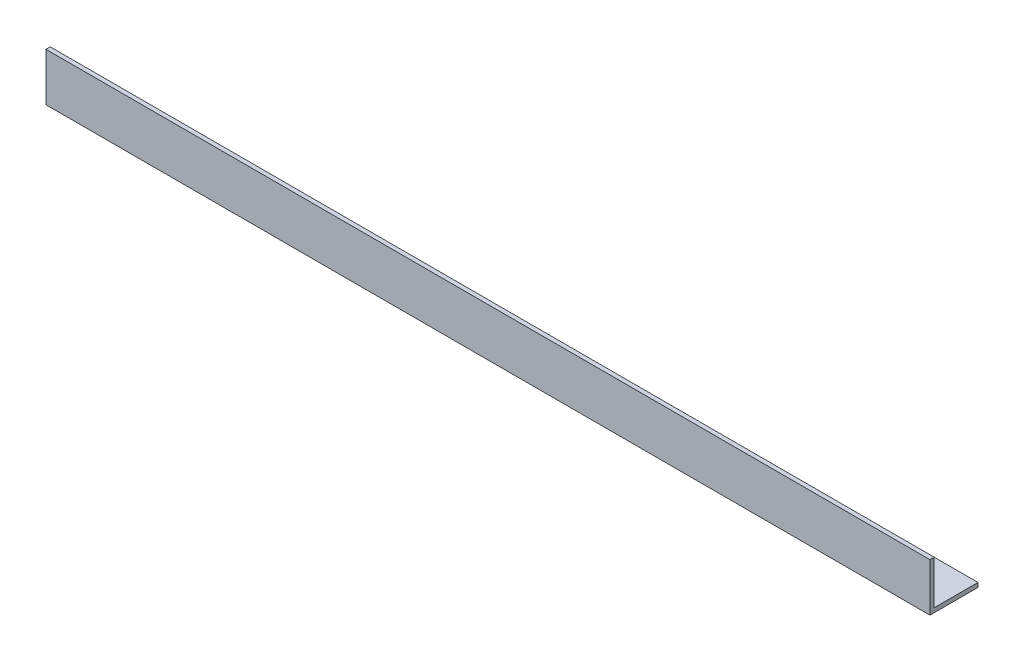
ISO-10303-21;
HEADER;
FILE_DESCRIPTION(('STEP AP214'),'2;1');
FILE_NAME('part.step','',(''),(''),'','','');
FILE_SCHEMA(('AUTOMOTIVE_DESIGN { 1 0 10303 214 1 1 1 1 }'));
ENDSEC;
DATA;
#1=APPLICATION_CONTEXT('core data for automotive mechanical design processes');
#2=APPLICATION_PROTOCOL_DEFINITION('international standard','automotive_design',2000,#1);
#3=PRODUCT_CONTEXT('',#1,'mechanical');
#4=PRODUCT('Part','Part','',(#3));
#5=PRODUCT_RELATED_PRODUCT_CATEGORY('part','',(#4));
#6=PRODUCT_DEFINITION_FORMATION('','',#4);
#7=PRODUCT_DEFINITION_CONTEXT('part definition',#1,'design');
#8=PRODUCT_DEFINITION('design','',#6,#7);
#9=PRODUCT_DEFINITION_SHAPE('','',#8);
#10=(LENGTH_UNIT() NAMED_UNIT(*) SI_UNIT(.MILLI.,.METRE.));
#11=(NAMED_UNIT(*) PLANE_ANGLE_UNIT() SI_UNIT($,.RADIAN.));
#12=(NAMED_UNIT(*) SI_UNIT($,.STERADIAN.) SOLID_ANGLE_UNIT());
#13=UNCERTAINTY_MEASURE_WITH_UNIT(LENGTH_MEASURE(1.E-05),#10,'distance_accuracy_value','');
#14=(GEOMETRIC_REPRESENTATION_CONTEXT(3) GLOBAL_UNCERTAINTY_ASSIGNED_CONTEXT((#13)) GLOBAL_UNIT_ASSIGNED_CONTEXT((#10,
#11,#12)) REPRESENTATION_CONTEXT('',''));
#15=CARTESIAN_POINT('',(0.,0.,0.));
#16=DIRECTION('',(0.,0.,1.));
#17=DIRECTION('',(1.,0.,0.));
#18=AXIS2_PLACEMENT_3D('',#15,#16,#17);
#19=CARTESIAN_POINT('',(620.,0.,0.));
#20=DIRECTION('',(0.,1.,0.));
#21=DIRECTION('',(0.,0.,1.));
#22=AXIS2_PLACEMENT_3D('',#19,#20,#21);
#23=PLANE('',#22);
#24=DIRECTION('',(0.,0.,-1.));
#25=VECTOR('',#24,1.);
#26=CARTESIAN_POINT('',(0.,0.,0.));
#27=LINE('',#26,#25);
#28=CARTESIAN_POINT('',(0.,0.,0.));
#29=VERTEX_POINT('',#28);
#30=CARTESIAN_POINT('',(0.,0.,-33.7));
#31=VERTEX_POINT('',#30);
#32=EDGE_CURVE('E115',#29,#31,#27,.T.);
#33=ORIENTED_EDGE('',*,*,#32,.T.);
#34=DIRECTION('',(-1.,0.,0.));
#35=VECTOR('',#34,1.);
#36=CARTESIAN_POINT('',(620.,0.,-33.7));
#37=LINE('',#36,#35);
#38=CARTESIAN_POINT('',(620.,0.,-33.7));
#39=VERTEX_POINT('',#38);
#40=EDGE_CURVE('E11',#39,#31,#37,.T.);
#41=ORIENTED_EDGE('',*,*,#40,.F.);
#42=DIRECTION('',(0.,0.,-1.));
#43=VECTOR('',#42,1.);
#44=CARTESIAN_POINT('',(620.,0.,0.));
#45=LINE('',#44,#43);
#46=CARTESIAN_POINT('',(620.,0.,0.));
#47=VERTEX_POINT('',#46);
#48=EDGE_CURVE('E80',#47,#39,#45,.T.);
#49=ORIENTED_EDGE('',*,*,#48,.F.);
#50=DIRECTION('',(-1.,0.,0.));
#51=VECTOR('',#50,1.);
#52=CARTESIAN_POINT('',(620.,0.,0.));
#53=LINE('',#52,#51);
#54=EDGE_CURVE('E111',#47,#29,#53,.T.);
#55=ORIENTED_EDGE('',*,*,#54,.T.);
#56=EDGE_LOOP('',(#33,#41,#49,#55));
#57=FACE_BOUND('',#56,.T.);
#58=ADVANCED_FACE('F34',(#57),#23,.F.);
#59=CARTESIAN_POINT('',(620.,3.,-33.7));
#60=DIRECTION('',(0.,0.,-1.));
#61=DIRECTION('',(-1.,0.,0.));
#62=AXIS2_PLACEMENT_3D('',#59,#60,#61);
#63=PLANE('',#62);
#64=DIRECTION('',(0.,-1.,0.));
#65=VECTOR('',#64,1.);
#66=CARTESIAN_POINT('',(0.,3.,-33.7));
#67=LINE('',#66,#65);
#68=CARTESIAN_POINT('',(0.,3.,-33.7));
#69=VERTEX_POINT('',#68);
#70=EDGE_CURVE('E118',#69,#31,#67,.T.);
#71=ORIENTED_EDGE('',*,*,#70,.F.);
#72=DIRECTION('',(-1.,0.,0.));
#73=VECTOR('',#72,1.);
#74=CARTESIAN_POINT('',(620.,3.,-33.7));
#75=LINE('',#74,#73);
#76=CARTESIAN_POINT('',(620.,3.,-33.7));
#77=VERTEX_POINT('',#76);
#78=EDGE_CURVE('E42',#77,#69,#75,.T.);
#79=ORIENTED_EDGE('',*,*,#78,.F.);
#80=DIRECTION('',(0.,-1.,0.));
#81=VECTOR('',#80,1.);
#82=CARTESIAN_POINT('',(620.,3.,-33.7));
#83=LINE('',#82,#81);
#84=EDGE_CURVE('E204',#77,#39,#83,.T.);
#85=ORIENTED_EDGE('',*,*,#84,.T.);
#86=ORIENTED_EDGE('',*,*,#40,.T.);
#87=EDGE_LOOP('',(#71,#79,#85,#86));
#88=FACE_BOUND('',#87,.T.);
#89=ADVANCED_FACE('F136',(#88),#63,.T.);
#90=CARTESIAN_POINT('',(620.,3.,0.));
#91=DIRECTION('',(0.,1.,0.));
#92=DIRECTION('',(0.,0.,1.));
#93=AXIS2_PLACEMENT_3D('',#90,#91,#92);
#94=PLANE('',#93);
#95=DIRECTION('',(0.,0.,-1.));
#96=VECTOR('',#95,1.);
#97=CARTESIAN_POINT('',(0.,3.,0.));
#98=LINE('',#97,#96);
#99=CARTESIAN_POINT('',(0.,3.,-3.));
#100=VERTEX_POINT('',#99);
#101=EDGE_CURVE('E121',#100,#69,#98,.T.);
#102=ORIENTED_EDGE('',*,*,#101,.F.);
#103=DIRECTION('',(-1.,0.,0.));
#104=VECTOR('',#103,1.);
#105=CARTESIAN_POINT('',(620.,3.,-3.));
#106=LINE('',#105,#104);
#107=CARTESIAN_POINT('',(620.,3.,-3.));
#108=VERTEX_POINT('',#107);
#109=EDGE_CURVE('E101',#108,#100,#106,.T.);
#110=ORIENTED_EDGE('',*,*,#109,.F.);
#111=DIRECTION('',(0.,0.,-1.));
#112=VECTOR('',#111,1.);
#113=CARTESIAN_POINT('',(620.,3.,0.));
#114=LINE('',#113,#112);
#115=EDGE_CURVE('E107',#108,#77,#114,.T.);
#116=ORIENTED_EDGE('',*,*,#115,.T.);
#117=ORIENTED_EDGE('',*,*,#78,.T.);
#118=EDGE_LOOP('',(#102,#110,#116,#117));
#119=FACE_BOUND('',#118,.T.);
#120=ADVANCED_FACE('F133',(#119),#94,.T.);
#121=CARTESIAN_POINT('',(620.,33.7,-3.));
#122=DIRECTION('',(0.,0.,-1.));
#123=DIRECTION('',(0.,1.,0.));
#124=AXIS2_PLACEMENT_3D('',#121,#122,#123);
#125=PLANE('',#124);
#126=DIRECTION('',(0.,-1.,0.));
#127=VECTOR('',#126,1.);
#128=CARTESIAN_POINT('',(0.,33.7,-3.));
#129=LINE('',#128,#127);
#130=CARTESIAN_POINT('',(0.,33.7,-3.));
#131=VERTEX_POINT('',#130);
#132=EDGE_CURVE('E96',#131,#100,#129,.T.);
#133=ORIENTED_EDGE('',*,*,#132,.F.);
#134=DIRECTION('',(-1.,0.,0.));
#135=VECTOR('',#134,1.);
#136=CARTESIAN_POINT('',(620.,33.7,-3.));
#137=LINE('',#136,#135);
#138=CARTESIAN_POINT('',(620.,33.7,-3.));
#139=VERTEX_POINT('',#138);
#140=EDGE_CURVE('E91',#139,#131,#137,.T.);
#141=ORIENTED_EDGE('',*,*,#140,.F.);
#142=DIRECTION('',(0.,-1.,0.));
#143=VECTOR('',#142,1.);
#144=CARTESIAN_POINT('',(620.,33.7,-3.));
#145=LINE('',#144,#143);
#146=EDGE_CURVE('E94',#139,#108,#145,.T.);
#147=ORIENTED_EDGE('',*,*,#146,.T.);
#148=ORIENTED_EDGE('',*,*,#109,.T.);
#149=EDGE_LOOP('',(#133,#141,#147,#148));
#150=FACE_BOUND('',#149,.T.);
#151=ADVANCED_FACE('F93',(#150),#125,.T.);
#152=CARTESIAN_POINT('',(620.,33.7,0.));
#153=DIRECTION('',(0.,1.,0.));
#154=DIRECTION('',(0.,0.,1.));
#155=AXIS2_PLACEMENT_3D('',#152,#153,#154);
#156=PLANE('',#155);
#157=DIRECTION('',(0.,0.,-1.));
#158=VECTOR('',#157,1.);
#159=CARTESIAN_POINT('',(0.,33.7,0.));
#160=LINE('',#159,#158);
#161=CARTESIAN_POINT('',(0.,33.7,0.));
#162=VERTEX_POINT('',#161);
#163=EDGE_CURVE('E125',#162,#131,#160,.T.);
#164=ORIENTED_EDGE('',*,*,#163,.F.);
#165=DIRECTION('',(-1.,0.,0.));
#166=VECTOR('',#165,1.);
#167=CARTESIAN_POINT('',(620.,33.7,0.));
#168=LINE('',#167,#166);
#169=CARTESIAN_POINT('',(620.,33.7,0.));
#170=VERTEX_POINT('',#169);
#171=EDGE_CURVE('E71',#170,#162,#168,.T.);
#172=ORIENTED_EDGE('',*,*,#171,.F.);
#173=DIRECTION('',(0.,0.,-1.));
#174=VECTOR('',#173,1.);
#175=CARTESIAN_POINT('',(620.,33.7,0.));
#176=LINE('',#175,#174);
#177=EDGE_CURVE('E105',#170,#139,#176,.T.);
#178=ORIENTED_EDGE('',*,*,#177,.T.);
#179=ORIENTED_EDGE('',*,*,#140,.T.);
#180=EDGE_LOOP('',(#164,#172,#178,#179));
#181=FACE_BOUND('',#180,.T.);
#182=ADVANCED_FACE('F109',(#181),#156,.T.);
#183=CARTESIAN_POINT('',(620.,33.7,0.));
#184=DIRECTION('',(0.,0.,-1.));
#185=DIRECTION('',(0.,1.,0.));
#186=AXIS2_PLACEMENT_3D('',#183,#184,#185);
#187=PLANE('',#186);
#188=DIRECTION('',(0.,-1.,0.));
#189=VECTOR('',#188,1.);
#190=CARTESIAN_POINT('',(0.,33.7,0.));
#191=LINE('',#190,#189);
#192=EDGE_CURVE('E74',#162,#29,#191,.T.);
#193=ORIENTED_EDGE('',*,*,#192,.T.);
#194=ORIENTED_EDGE('',*,*,#54,.F.);
#195=DIRECTION('',(0.,-1.,0.));
#196=VECTOR('',#195,1.);
#197=CARTESIAN_POINT('',(620.,33.7,0.));
#198=LINE('',#197,#196);
#199=EDGE_CURVE('E50',#170,#47,#198,.T.);
#200=ORIENTED_EDGE('',*,*,#199,.F.);
#201=ORIENTED_EDGE('',*,*,#171,.T.);
#202=EDGE_LOOP('',(#193,#194,#200,#201));
#203=FACE_BOUND('',#202,.T.);
#204=ADVANCED_FACE('F141',(#203),#187,.F.);
#205=CARTESIAN_POINT('',(620.,0.,0.));
#206=DIRECTION('',(-1.,0.,0.));
#207=DIRECTION('',(0.,0.,1.));
#208=AXIS2_PLACEMENT_3D('',#205,#206,#207);
#209=PLANE('',#208);
#210=ORIENTED_EDGE('',*,*,#48,.T.);
#211=ORIENTED_EDGE('',*,*,#84,.F.);
#212=ORIENTED_EDGE('',*,*,#115,.F.);
#213=ORIENTED_EDGE('',*,*,#146,.F.);
#214=ORIENTED_EDGE('',*,*,#177,.F.);
#215=ORIENTED_EDGE('',*,*,#199,.T.);
#216=EDGE_LOOP('',(#210,#211,#212,#213,#214,#215));
#217=FACE_BOUND('',#216,.T.);
#218=ADVANCED_FACE('F104',(#217),#209,.F.);
#219=CARTESIAN_POINT('',(0.,0.,0.));
#220=DIRECTION('',(-1.,0.,0.));
#221=DIRECTION('',(0.,0.,1.));
#222=AXIS2_PLACEMENT_3D('',#219,#220,#221);
#223=PLANE('',#222);
#224=ORIENTED_EDGE('',*,*,#32,.F.);
#225=ORIENTED_EDGE('',*,*,#192,.F.);
#226=ORIENTED_EDGE('',*,*,#163,.T.);
#227=ORIENTED_EDGE('',*,*,#132,.T.);
#228=ORIENTED_EDGE('',*,*,#101,.T.);
#229=ORIENTED_EDGE('',*,*,#70,.T.);
#230=EDGE_LOOP('',(#224,#225,#226,#227,#228,#229));
#231=FACE_BOUND('',#230,.T.);
#232=ADVANCED_FACE('F139',(#231),#223,.T.);
#233=CLOSED_SHELL('',(#58,#89,#120,#151,#182,#204,#218,#232));
#234=MANIFOLD_SOLID_BREP('B2',#233);
#235=ADVANCED_BREP_SHAPE_REPRESENTATION('',(#18,#234),#14);
#236=SHAPE_DEFINITION_REPRESENTATION(#9,#235);
ENDSEC;
END-ISO-10303-21;
